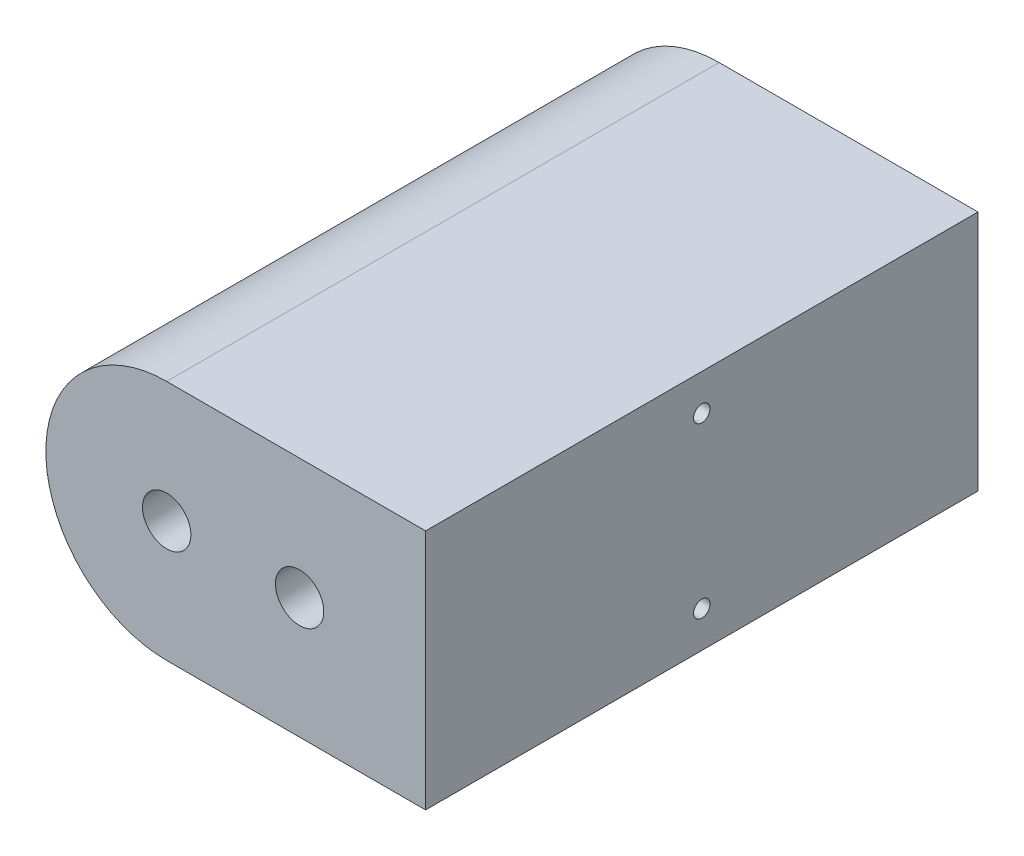
ISO-10303-21;
HEADER;
FILE_DESCRIPTION(('STEP AP214'),'2;1');
FILE_NAME('part.step','',(''),(''),'','','');
FILE_SCHEMA(('AUTOMOTIVE_DESIGN { 1 0 10303 214 1 1 1 1 }'));
ENDSEC;
DATA;
#1=APPLICATION_CONTEXT('core data for automotive mechanical design processes');
#2=APPLICATION_PROTOCOL_DEFINITION('international standard','automotive_design',2000,#1);
#3=PRODUCT_CONTEXT('',#1,'mechanical');
#4=PRODUCT('Part','Part','',(#3));
#5=PRODUCT_RELATED_PRODUCT_CATEGORY('part','',(#4));
#6=PRODUCT_DEFINITION_FORMATION('','',#4);
#7=PRODUCT_DEFINITION_CONTEXT('part definition',#1,'design');
#8=PRODUCT_DEFINITION('design','',#6,#7);
#9=PRODUCT_DEFINITION_SHAPE('','',#8);
#10=(LENGTH_UNIT() NAMED_UNIT(*) SI_UNIT(.MILLI.,.METRE.));
#11=(NAMED_UNIT(*) PLANE_ANGLE_UNIT() SI_UNIT($,.RADIAN.));
#12=(NAMED_UNIT(*) SI_UNIT($,.STERADIAN.) SOLID_ANGLE_UNIT());
#13=UNCERTAINTY_MEASURE_WITH_UNIT(LENGTH_MEASURE(1.E-05),#10,'distance_accuracy_value','');
#14=(GEOMETRIC_REPRESENTATION_CONTEXT(3) GLOBAL_UNCERTAINTY_ASSIGNED_CONTEXT((#13)) GLOBAL_UNIT_ASSIGNED_CONTEXT((#10,
#11,#12)) REPRESENTATION_CONTEXT('',''));
#15=CARTESIAN_POINT('',(0.,0.,0.));
#16=DIRECTION('',(0.,0.,1.));
#17=DIRECTION('',(1.,0.,0.));
#18=AXIS2_PLACEMENT_3D('',#15,#16,#17);
#19=CARTESIAN_POINT('',(22.0895071336129,-15.,194.285714285714));
#20=DIRECTION('',(-1.,0.,0.));
#21=DIRECTION('',(0.,0.,1.));
#22=AXIS2_PLACEMENT_3D('',#19,#20,#21);
#23=PLANE('',#22);
#24=CARTESIAN_POINT('',(22.0895071336129,70.,80.));
#25=DIRECTION('',(1.,0.,0.));
#26=DIRECTION('',(0.,0.,-1.));
#27=AXIS2_PLACEMENT_3D('',#24,#25,#26);
#28=CIRCLE('',#27,3.4);
#29=CARTESIAN_POINT('',(22.0895071336129,70.,76.6));
#30=VERTEX_POINT('',#29);
#31=EDGE_CURVE('E99',#30,#30,#28,.T.);
#32=ORIENTED_EDGE('',*,*,#31,.F.);
#33=EDGE_LOOP('',(#32));
#34=FACE_BOUND('',#33,.T.);
#35=CARTESIAN_POINT('',(22.0895071336129,0.,80.));
#36=DIRECTION('',(1.,0.,0.));
#37=DIRECTION('',(0.,0.,-1.));
#38=AXIS2_PLACEMENT_3D('',#35,#36,#37);
#39=CIRCLE('',#38,3.4);
#40=CARTESIAN_POINT('',(22.0895071336129,0.,76.6));
#41=VERTEX_POINT('',#40);
#42=EDGE_CURVE('E98',#41,#41,#39,.T.);
#43=ORIENTED_EDGE('',*,*,#42,.F.);
#44=EDGE_LOOP('',(#43));
#45=FACE_BOUND('',#44,.T.);
#46=DIRECTION('',(0.,1.,0.));
#47=VECTOR('',#46,1.);
#48=CARTESIAN_POINT('',(22.0895071336129,-15.,-34.2857142857143));
#49=LINE('',#48,#47);
#50=CARTESIAN_POINT('',(22.0895071336129,-15.,-34.2857142857143));
#51=VERTEX_POINT('',#50);
#52=CARTESIAN_POINT('',(22.0895071336129,85.,-34.2857142857143));
#53=VERTEX_POINT('',#52);
#54=EDGE_CURVE('E121',#51,#53,#49,.T.);
#55=ORIENTED_EDGE('',*,*,#54,.T.);
#56=DIRECTION('',(0.,0.,-1.));
#57=VECTOR('',#56,1.);
#58=CARTESIAN_POINT('',(22.0895071336129,85.,194.285714285714));
#59=LINE('',#58,#57);
#60=CARTESIAN_POINT('',(22.0895071336129,85.,194.285714285714));
#61=VERTEX_POINT('',#60);
#62=EDGE_CURVE('E11',#61,#53,#59,.T.);
#63=ORIENTED_EDGE('',*,*,#62,.F.);
#64=DIRECTION('',(0.,1.,0.));
#65=VECTOR('',#64,1.);
#66=CARTESIAN_POINT('',(22.0895071336129,-15.,194.285714285714));
#67=LINE('',#66,#65);
#68=CARTESIAN_POINT('',(22.0895071336129,-15.,194.285714285714));
#69=VERTEX_POINT('',#68);
#70=EDGE_CURVE('E122',#69,#61,#67,.T.);
#71=ORIENTED_EDGE('',*,*,#70,.F.);
#72=DIRECTION('',(0.,0.,-1.));
#73=VECTOR('',#72,1.);
#74=CARTESIAN_POINT('',(22.0895071336129,-15.,194.285714285714));
#75=LINE('',#74,#73);
#76=EDGE_CURVE('E128',#69,#51,#75,.T.);
#77=ORIENTED_EDGE('',*,*,#76,.T.);
#78=EDGE_LOOP('',(#55,#63,#71,#77));
#79=FACE_BOUND('',#78,.T.);
#80=ADVANCED_FACE('F34',(#34,#45,#79),#23,.F.);
#81=CARTESIAN_POINT('',(22.0895071336129,85.,194.285714285714));
#82=DIRECTION('',(0.,-1.,0.));
#83=DIRECTION('',(1.,0.,0.));
#84=AXIS2_PLACEMENT_3D('',#81,#82,#83);
#85=PLANE('',#84);
#86=DIRECTION('',(-1.,0.,0.));
#87=VECTOR('',#86,1.);
#88=CARTESIAN_POINT('',(22.0895071336129,85.,-34.2857142857143));
#89=LINE('',#88,#87);
#90=CARTESIAN_POINT('',(-85.0533500092442,85.,-34.2857142857143));
#91=VERTEX_POINT('',#90);
#92=EDGE_CURVE('E131',#53,#91,#89,.T.);
#93=ORIENTED_EDGE('',*,*,#92,.T.);
#94=DIRECTION('',(0.,0.,-1.));
#95=VECTOR('',#94,1.);
#96=CARTESIAN_POINT('',(-85.0533500092442,85.,194.285714285714));
#97=LINE('',#96,#95);
#98=CARTESIAN_POINT('',(-85.0533500092442,85.,194.285714285714));
#99=VERTEX_POINT('',#98);
#100=EDGE_CURVE('E42',#99,#91,#97,.T.);
#101=ORIENTED_EDGE('',*,*,#100,.F.);
#102=DIRECTION('',(-1.,0.,0.));
#103=VECTOR('',#102,1.);
#104=CARTESIAN_POINT('',(22.0895071336129,85.,194.285714285714));
#105=LINE('',#104,#103);
#106=EDGE_CURVE('E81',#61,#99,#105,.T.);
#107=ORIENTED_EDGE('',*,*,#106,.F.);
#108=ORIENTED_EDGE('',*,*,#62,.T.);
#109=EDGE_LOOP('',(#93,#101,#107,#108));
#110=FACE_BOUND('',#109,.T.);
#111=ADVANCED_FACE('F155',(#110),#85,.F.);
#112=CARTESIAN_POINT('',(-85.0533500092442,35.,194.285714285714));
#113=DIRECTION('',(0.,0.,-1.));
#114=DIRECTION('',(-1.,0.,0.));
#115=AXIS2_PLACEMENT_3D('',#112,#113,#114);
#116=CYLINDRICAL_SURFACE('',#115,50.);
#117=CARTESIAN_POINT('',(-85.0533500092442,35.,-34.2857142857143));
#118=DIRECTION('',(0.,0.,1.));
#119=DIRECTION('',(-1.,0.,0.));
#120=AXIS2_PLACEMENT_3D('',#117,#118,#119);
#121=CIRCLE('',#120,50.);
#122=CARTESIAN_POINT('',(-85.0533500092442,-15.,-34.2857142857143));
#123=VERTEX_POINT('',#122);
#124=EDGE_CURVE('E68',#91,#123,#121,.T.);
#125=ORIENTED_EDGE('',*,*,#124,.T.);
#126=DIRECTION('',(0.,0.,-1.));
#127=VECTOR('',#126,1.);
#128=CARTESIAN_POINT('',(-85.0533500092442,-15.,194.285714285714));
#129=LINE('',#128,#127);
#130=CARTESIAN_POINT('',(-85.0533500092442,-15.,194.285714285714));
#131=VERTEX_POINT('',#130);
#132=EDGE_CURVE('E136',#131,#123,#129,.T.);
#133=ORIENTED_EDGE('',*,*,#132,.F.);
#134=CARTESIAN_POINT('',(-85.0533500092442,35.,194.285714285714));
#135=DIRECTION('',(0.,0.,1.));
#136=DIRECTION('',(-1.,0.,0.));
#137=AXIS2_PLACEMENT_3D('',#134,#135,#136);
#138=CIRCLE('',#137,50.);
#139=EDGE_CURVE('E125',#99,#131,#138,.T.);
#140=ORIENTED_EDGE('',*,*,#139,.F.);
#141=ORIENTED_EDGE('',*,*,#100,.T.);
#142=EDGE_LOOP('',(#125,#133,#140,#141));
#143=FACE_BOUND('',#142,.T.);
#144=ADVANCED_FACE('F138',(#143),#116,.T.);
#145=CARTESIAN_POINT('',(22.0895071336129,-15.,194.285714285714));
#146=DIRECTION('',(0.,1.,0.));
#147=DIRECTION('',(-1.,0.,0.));
#148=AXIS2_PLACEMENT_3D('',#145,#146,#147);
#149=PLANE('',#148);
#150=DIRECTION('',(1.,0.,0.));
#151=VECTOR('',#150,1.);
#152=CARTESIAN_POINT('',(22.0895071336129,-15.,-34.2857142857143));
#153=LINE('',#152,#151);
#154=EDGE_CURVE('E74',#123,#51,#153,.T.);
#155=ORIENTED_EDGE('',*,*,#154,.T.);
#156=ORIENTED_EDGE('',*,*,#76,.F.);
#157=DIRECTION('',(1.,0.,0.));
#158=VECTOR('',#157,1.);
#159=CARTESIAN_POINT('',(22.0895071336129,-15.,194.285714285714));
#160=LINE('',#159,#158);
#161=EDGE_CURVE('E50',#131,#69,#160,.T.);
#162=ORIENTED_EDGE('',*,*,#161,.F.);
#163=ORIENTED_EDGE('',*,*,#132,.T.);
#164=EDGE_LOOP('',(#155,#156,#162,#163));
#165=FACE_BOUND('',#164,.T.);
#166=ADVANCED_FACE('F145',(#165),#149,.F.);
#167=CARTESIAN_POINT('',(-85.0533500092442,35.,194.285714285714));
#168=DIRECTION('',(0.,0.,-1.));
#169=DIRECTION('',(-1.,0.,0.));
#170=AXIS2_PLACEMENT_3D('',#167,#168,#169);
#171=PLANE('',#170);
#172=CARTESIAN_POINT('',(-30.0533500092442,35.,194.285714285714));
#173=DIRECTION('',(0.,0.,-1.));
#174=DIRECTION('',(-1.,0.,0.));
#175=AXIS2_PLACEMENT_3D('',#172,#173,#174);
#176=CIRCLE('',#175,9.99999999999996);
#177=CARTESIAN_POINT('',(-40.0533500092442,35.,194.285714285714));
#178=VERTEX_POINT('',#177);
#179=EDGE_CURVE('E112',#178,#178,#176,.T.);
#180=ORIENTED_EDGE('',*,*,#179,.T.);
#181=EDGE_LOOP('',(#180));
#182=FACE_BOUND('',#181,.T.);
#183=CARTESIAN_POINT('',(-85.0533500092442,35.,194.285714285714));
#184=DIRECTION('',(0.,0.,-1.));
#185=DIRECTION('',(-1.,0.,0.));
#186=AXIS2_PLACEMENT_3D('',#183,#184,#185);
#187=CIRCLE('',#186,9.99999999999997);
#188=CARTESIAN_POINT('',(-95.0533500092442,35.,194.285714285714));
#189=VERTEX_POINT('',#188);
#190=EDGE_CURVE('E118',#189,#189,#187,.T.);
#191=ORIENTED_EDGE('',*,*,#190,.T.);
#192=EDGE_LOOP('',(#191));
#193=FACE_BOUND('',#192,.T.);
#194=ORIENTED_EDGE('',*,*,#70,.T.);
#195=ORIENTED_EDGE('',*,*,#106,.T.);
#196=ORIENTED_EDGE('',*,*,#139,.T.);
#197=ORIENTED_EDGE('',*,*,#161,.T.);
#198=EDGE_LOOP('',(#194,#195,#196,#197));
#199=FACE_BOUND('',#198,.T.);
#200=ADVANCED_FACE('F147',(#182,#193,#199),#171,.F.);
#201=CARTESIAN_POINT('',(-85.0533500092442,35.,-34.2857142857143));
#202=DIRECTION('',(0.,0.,-1.));
#203=DIRECTION('',(-1.,0.,0.));
#204=AXIS2_PLACEMENT_3D('',#201,#202,#203);
#205=PLANE('',#204);
#206=CARTESIAN_POINT('',(-30.0533500092442,35.,-34.2857142857143));
#207=DIRECTION('',(0.,0.,-1.));
#208=DIRECTION('',(-1.,0.,0.));
#209=AXIS2_PLACEMENT_3D('',#206,#207,#208);
#210=CIRCLE('',#209,9.99999999999999);
#211=CARTESIAN_POINT('',(-40.0533500092442,35.,-34.2857142857143));
#212=VERTEX_POINT('',#211);
#213=EDGE_CURVE('E109',#212,#212,#210,.T.);
#214=ORIENTED_EDGE('',*,*,#213,.F.);
#215=EDGE_LOOP('',(#214));
#216=FACE_BOUND('',#215,.T.);
#217=CARTESIAN_POINT('',(-85.0533500092442,35.,-34.2857142857143));
#218=DIRECTION('',(0.,0.,-1.));
#219=DIRECTION('',(-1.,0.,0.));
#220=AXIS2_PLACEMENT_3D('',#217,#218,#219);
#221=CIRCLE('',#220,9.99999999999999);
#222=CARTESIAN_POINT('',(-95.0533500092442,35.,-34.2857142857143));
#223=VERTEX_POINT('',#222);
#224=EDGE_CURVE('E115',#223,#223,#221,.T.);
#225=ORIENTED_EDGE('',*,*,#224,.F.);
#226=EDGE_LOOP('',(#225));
#227=FACE_BOUND('',#226,.T.);
#228=ORIENTED_EDGE('',*,*,#54,.F.);
#229=ORIENTED_EDGE('',*,*,#154,.F.);
#230=ORIENTED_EDGE('',*,*,#124,.F.);
#231=ORIENTED_EDGE('',*,*,#92,.F.);
#232=EDGE_LOOP('',(#228,#229,#230,#231));
#233=FACE_BOUND('',#232,.T.);
#234=ADVANCED_FACE('F141',(#216,#227,#233),#205,.T.);
#235=CARTESIAN_POINT('',(-85.0533500092442,35.,-34.2857142857143));
#236=DIRECTION('',(0.,0.,-1.));
#237=DIRECTION('',(-1.,0.,0.));
#238=AXIS2_PLACEMENT_3D('',#235,#236,#237);
#239=CYLINDRICAL_SURFACE('',#238,9.99999999999998);
#240=ORIENTED_EDGE('',*,*,#190,.F.);
#241=EDGE_LOOP('',(#240));
#242=FACE_BOUND('',#241,.T.);
#243=ORIENTED_EDGE('',*,*,#224,.T.);
#244=EDGE_LOOP('',(#243));
#245=FACE_BOUND('',#244,.T.);
#246=ADVANCED_FACE('F182',(#242,#245),#239,.F.);
#247=CARTESIAN_POINT('',(-30.0533500092442,35.,-34.2857142857143));
#248=DIRECTION('',(0.,0.,-1.));
#249=DIRECTION('',(-1.,0.,0.));
#250=AXIS2_PLACEMENT_3D('',#247,#248,#249);
#251=CYLINDRICAL_SURFACE('',#250,9.99999999999997);
#252=ORIENTED_EDGE('',*,*,#179,.F.);
#253=EDGE_LOOP('',(#252));
#254=FACE_BOUND('',#253,.T.);
#255=ORIENTED_EDGE('',*,*,#213,.T.);
#256=EDGE_LOOP('',(#255));
#257=FACE_BOUND('',#256,.T.);
#258=ADVANCED_FACE('F174',(#254,#257),#251,.F.);
#259=CARTESIAN_POINT('',(-0.160492866387089,0.,80.));
#260=DIRECTION('',(1.,0.,0.));
#261=DIRECTION('',(0.,0.,-1.));
#262=AXIS2_PLACEMENT_3D('',#259,#260,#261);
#263=CONICAL_SURFACE('',#262,3.4,1.02974425867665);
#264=CARTESIAN_POINT('',(-2.20341897108079,0.,80.));
#265=VERTEX_POINT('',#264);
#266=VERTEX_LOOP('',#265);
#267=FACE_BOUND('',#266,.T.);
#268=CARTESIAN_POINT('',(-0.160492866387089,0.,80.));
#269=DIRECTION('',(1.,0.,0.));
#270=DIRECTION('',(0.,0.,-1.));
#271=AXIS2_PLACEMENT_3D('',#268,#269,#270);
#272=CIRCLE('',#271,3.4);
#273=CARTESIAN_POINT('',(-0.160492866387089,0.,76.6));
#274=VERTEX_POINT('',#273);
#275=EDGE_CURVE('E102',#274,#274,#272,.T.);
#276=ORIENTED_EDGE('',*,*,#275,.T.);
#277=EDGE_LOOP('',(#276));
#278=FACE_BOUND('',#277,.T.);
#279=ADVANCED_FACE('F168',(#267,#278),#263,.F.);
#280=CARTESIAN_POINT('',(22.0895071336129,0.,80.));
#281=DIRECTION('',(1.,0.,0.));
#282=DIRECTION('',(0.,0.,-1.));
#283=AXIS2_PLACEMENT_3D('',#280,#281,#282);
#284=CYLINDRICAL_SURFACE('',#283,3.4);
#285=ORIENTED_EDGE('',*,*,#275,.F.);
#286=EDGE_LOOP('',(#285));
#287=FACE_BOUND('',#286,.T.);
#288=ORIENTED_EDGE('',*,*,#42,.T.);
#289=EDGE_LOOP('',(#288));
#290=FACE_BOUND('',#289,.T.);
#291=ADVANCED_FACE('F92',(#287,#290),#284,.F.);
#292=CARTESIAN_POINT('',(-0.160492866387089,70.,80.));
#293=DIRECTION('',(1.,0.,0.));
#294=DIRECTION('',(0.,0.,-1.));
#295=AXIS2_PLACEMENT_3D('',#292,#293,#294);
#296=CONICAL_SURFACE('',#295,3.4,1.02974425867665);
#297=CARTESIAN_POINT('',(-2.20341897108079,70.,80.));
#298=VERTEX_POINT('',#297);
#299=VERTEX_LOOP('',#298);
#300=FACE_BOUND('',#299,.T.);
#301=CARTESIAN_POINT('',(-0.160492866387089,70.,80.));
#302=DIRECTION('',(1.,0.,0.));
#303=DIRECTION('',(0.,0.,-1.));
#304=AXIS2_PLACEMENT_3D('',#301,#302,#303);
#305=CIRCLE('',#304,3.4);
#306=CARTESIAN_POINT('',(-0.160492866387089,70.,76.6));
#307=VERTEX_POINT('',#306);
#308=EDGE_CURVE('E96',#307,#307,#305,.T.);
#309=ORIENTED_EDGE('',*,*,#308,.T.);
#310=EDGE_LOOP('',(#309));
#311=FACE_BOUND('',#310,.T.);
#312=ADVANCED_FACE('F88',(#300,#311),#296,.F.);
#313=CARTESIAN_POINT('',(22.0895071336129,70.,80.));
#314=DIRECTION('',(1.,0.,0.));
#315=DIRECTION('',(0.,0.,-1.));
#316=AXIS2_PLACEMENT_3D('',#313,#314,#315);
#317=CYLINDRICAL_SURFACE('',#316,3.4);
#318=ORIENTED_EDGE('',*,*,#308,.F.);
#319=EDGE_LOOP('',(#318));
#320=FACE_BOUND('',#319,.T.);
#321=ORIENTED_EDGE('',*,*,#31,.T.);
#322=EDGE_LOOP('',(#321));
#323=FACE_BOUND('',#322,.T.);
#324=ADVANCED_FACE('F91',(#320,#323),#317,.F.);
#325=CLOSED_SHELL('',(#80,#111,#144,#166,#200,#234,#246,#258,#279,#291,#312,#324));
#326=MANIFOLD_SOLID_BREP('B2',#325);
#327=ADVANCED_BREP_SHAPE_REPRESENTATION('',(#18,#326),#14);
#328=SHAPE_DEFINITION_REPRESENTATION(#9,#327);
ENDSEC;
END-ISO-10303-21;
